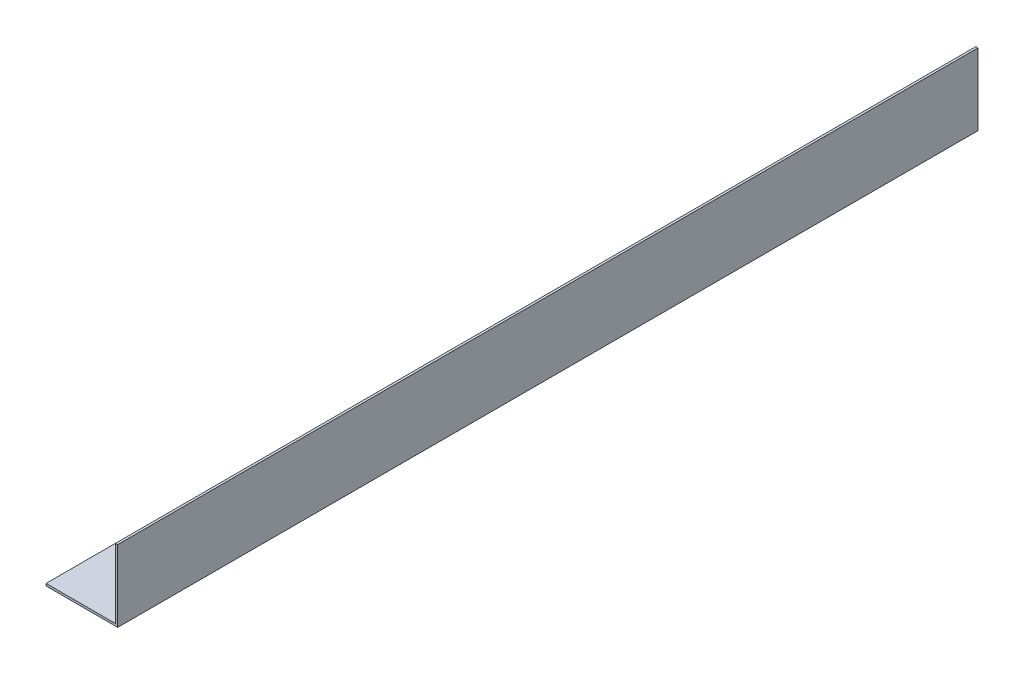
ISO-10303-21;
HEADER;
FILE_DESCRIPTION(('STEP AP214'),'2;1');
FILE_NAME('part.step','',(''),(''),'','','');
FILE_SCHEMA(('AUTOMOTIVE_DESIGN { 1 0 10303 214 1 1 1 1 }'));
ENDSEC;
DATA;
#1=APPLICATION_CONTEXT('core data for automotive mechanical design processes');
#2=APPLICATION_PROTOCOL_DEFINITION('international standard','automotive_design',2000,#1);
#3=PRODUCT_CONTEXT('',#1,'mechanical');
#4=PRODUCT('Part','Part','',(#3));
#5=PRODUCT_RELATED_PRODUCT_CATEGORY('part','',(#4));
#6=PRODUCT_DEFINITION_FORMATION('','',#4);
#7=PRODUCT_DEFINITION_CONTEXT('part definition',#1,'design');
#8=PRODUCT_DEFINITION('design','',#6,#7);
#9=PRODUCT_DEFINITION_SHAPE('','',#8);
#10=(LENGTH_UNIT() NAMED_UNIT(*) SI_UNIT(.MILLI.,.METRE.));
#11=(NAMED_UNIT(*) PLANE_ANGLE_UNIT() SI_UNIT($,.RADIAN.));
#12=(NAMED_UNIT(*) SI_UNIT($,.STERADIAN.) SOLID_ANGLE_UNIT());
#13=UNCERTAINTY_MEASURE_WITH_UNIT(LENGTH_MEASURE(1.E-05),#10,'distance_accuracy_value','');
#14=(GEOMETRIC_REPRESENTATION_CONTEXT(3) GLOBAL_UNCERTAINTY_ASSIGNED_CONTEXT((#13)) GLOBAL_UNIT_ASSIGNED_CONTEXT((#10,
#11,#12)) REPRESENTATION_CONTEXT('',''));
#15=CARTESIAN_POINT('',(0.,0.,0.));
#16=DIRECTION('',(0.,0.,1.));
#17=DIRECTION('',(1.,0.,0.));
#18=AXIS2_PLACEMENT_3D('',#15,#16,#17);
#19=CARTESIAN_POINT('',(0.,1.5875,609.6));
#20=DIRECTION('',(1.,0.,0.));
#21=DIRECTION('',(0.,1.,0.));
#22=AXIS2_PLACEMENT_3D('',#19,#20,#21);
#23=PLANE('',#22);
#24=DIRECTION('',(0.,-1.,0.));
#25=VECTOR('',#24,1.);
#26=CARTESIAN_POINT('',(0.,1.5875,0.));
#27=LINE('',#26,#25);
#28=CARTESIAN_POINT('',(0.,1.5875,0.));
#29=VERTEX_POINT('',#28);
#30=CARTESIAN_POINT('',(0.,0.,0.));
#31=VERTEX_POINT('',#30);
#32=EDGE_CURVE('E175',#29,#31,#27,.T.);
#33=ORIENTED_EDGE('',*,*,#32,.T.);
#34=DIRECTION('',(0.,0.,-1.));
#35=VECTOR('',#34,1.);
#36=CARTESIAN_POINT('',(0.,0.,609.6));
#37=LINE('',#36,#35);
#38=CARTESIAN_POINT('',(0.,0.,609.6));
#39=VERTEX_POINT('',#38);
#40=EDGE_CURVE('E222',#39,#31,#37,.T.);
#41=ORIENTED_EDGE('',*,*,#40,.F.);
#42=DIRECTION('',(0.,-1.,0.));
#43=VECTOR('',#42,1.);
#44=CARTESIAN_POINT('',(0.,1.5875,609.6));
#45=LINE('',#44,#43);
#46=CARTESIAN_POINT('',(0.,1.5875,609.6));
#47=VERTEX_POINT('',#46);
#48=EDGE_CURVE('E182',#47,#39,#45,.T.);
#49=ORIENTED_EDGE('',*,*,#48,.F.);
#50=DIRECTION('',(0.,0.,-1.));
#51=VECTOR('',#50,1.);
#52=CARTESIAN_POINT('',(0.,1.5875,609.6));
#53=LINE('',#52,#51);
#54=EDGE_CURVE('E196',#47,#29,#53,.T.);
#55=ORIENTED_EDGE('',*,*,#54,.T.);
#56=EDGE_LOOP('',(#33,#41,#49,#55));
#57=FACE_BOUND('',#56,.T.);
#58=ADVANCED_FACE('F33',(#57),#23,.F.);
#59=CARTESIAN_POINT('',(0.,0.,609.6));
#60=DIRECTION('',(0.,1.,0.));
#61=DIRECTION('',(0.,0.,1.));
#62=AXIS2_PLACEMENT_3D('',#59,#60,#61);
#63=PLANE('',#62);
#64=DIRECTION('',(-1.,0.,0.));
#65=VECTOR('',#64,1.);
#66=CARTESIAN_POINT('',(36.7071748683856,0.,61.2521));
#67=LINE('',#66,#65);
#68=CARTESIAN_POINT('',(36.7071748683856,0.,61.2521));
#69=VERTEX_POINT('',#68);
#70=CARTESIAN_POINT('',(20.6375,0.,61.2521));
#71=VERTEX_POINT('',#70);
#72=EDGE_CURVE('E145',#69,#71,#67,.T.);
#73=ORIENTED_EDGE('',*,*,#72,.F.);
#74=CARTESIAN_POINT('',(36.7071748683856,0.,57.15));
#75=DIRECTION('',(0.,-1.,0.));
#76=DIRECTION('',(0.,0.,1.));
#77=AXIS2_PLACEMENT_3D('',#74,#75,#76);
#78=CIRCLE('',#77,4.1021);
#79=CARTESIAN_POINT('',(36.7071748683856,0.,53.0479));
#80=VERTEX_POINT('',#79);
#81=EDGE_CURVE('E47',#80,#69,#78,.T.);
#82=ORIENTED_EDGE('',*,*,#81,.F.);
#83=DIRECTION('',(1.,0.,0.));
#84=VECTOR('',#83,1.);
#85=CARTESIAN_POINT('',(20.6375,0.,53.0479));
#86=LINE('',#85,#84);
#87=CARTESIAN_POINT('',(20.6375,0.,53.0479));
#88=VERTEX_POINT('',#87);
#89=EDGE_CURVE('E152',#88,#80,#86,.T.);
#90=ORIENTED_EDGE('',*,*,#89,.F.);
#91=CARTESIAN_POINT('',(20.6375,0.,57.15));
#92=DIRECTION('',(0.,-1.,0.));
#93=DIRECTION('',(0.,0.,1.));
#94=AXIS2_PLACEMENT_3D('',#91,#92,#93);
#95=CIRCLE('',#94,4.1021);
#96=EDGE_CURVE('E136',#71,#88,#95,.T.);
#97=ORIENTED_EDGE('',*,*,#96,.F.);
#98=EDGE_LOOP('',(#73,#82,#90,#97));
#99=FACE_BOUND('',#98,.T.);
#100=DIRECTION('',(1.,0.,0.));
#101=VECTOR('',#100,1.);
#102=CARTESIAN_POINT('',(36.7071748683856,0.,548.3479));
#103=LINE('',#102,#101);
#104=CARTESIAN_POINT('',(20.6375,0.,548.3479));
#105=VERTEX_POINT('',#104);
#106=CARTESIAN_POINT('',(36.7071748683856,0.,548.3479));
#107=VERTEX_POINT('',#106);
#108=EDGE_CURVE('E163',#105,#107,#103,.T.);
#109=ORIENTED_EDGE('',*,*,#108,.F.);
#110=CARTESIAN_POINT('',(20.6375,0.,552.45));
#111=DIRECTION('',(0.,-1.,0.));
#112=DIRECTION('',(0.,0.,-1.));
#113=AXIS2_PLACEMENT_3D('',#110,#111,#112);
#114=CIRCLE('',#113,4.1021);
#115=CARTESIAN_POINT('',(20.6375,0.,556.5521));
#116=VERTEX_POINT('',#115);
#117=EDGE_CURVE('E159',#116,#105,#114,.T.);
#118=ORIENTED_EDGE('',*,*,#117,.F.);
#119=DIRECTION('',(-1.,0.,0.));
#120=VECTOR('',#119,1.);
#121=CARTESIAN_POINT('',(20.6375,0.,556.5521));
#122=LINE('',#121,#120);
#123=CARTESIAN_POINT('',(36.7071748683856,0.,556.5521));
#124=VERTEX_POINT('',#123);
#125=EDGE_CURVE('E169',#124,#116,#122,.T.);
#126=ORIENTED_EDGE('',*,*,#125,.F.);
#127=CARTESIAN_POINT('',(36.7071748683856,0.,552.45));
#128=DIRECTION('',(0.,-1.,0.));
#129=DIRECTION('',(0.,0.,-1.));
#130=AXIS2_PLACEMENT_3D('',#127,#128,#129);
#131=CIRCLE('',#130,4.1021);
#132=EDGE_CURVE('E166',#107,#124,#131,.T.);
#133=ORIENTED_EDGE('',*,*,#132,.F.);
#134=EDGE_LOOP('',(#109,#118,#126,#133));
#135=FACE_BOUND('',#134,.T.);
#136=DIRECTION('',(1.,0.,0.));
#137=VECTOR('',#136,1.);
#138=CARTESIAN_POINT('',(0.,0.,0.));
#139=LINE('',#138,#137);
#140=CARTESIAN_POINT('',(50.8,0.,0.));
#141=VERTEX_POINT('',#140);
#142=EDGE_CURVE('E199',#31,#141,#139,.T.);
#143=ORIENTED_EDGE('',*,*,#142,.T.);
#144=DIRECTION('',(0.,0.,-1.));
#145=VECTOR('',#144,1.);
#146=CARTESIAN_POINT('',(50.8,0.,609.6));
#147=LINE('',#146,#145);
#148=CARTESIAN_POINT('',(50.8,0.,609.6));
#149=VERTEX_POINT('',#148);
#150=EDGE_CURVE('E219',#149,#141,#147,.T.);
#151=ORIENTED_EDGE('',*,*,#150,.F.);
#152=DIRECTION('',(1.,0.,0.));
#153=VECTOR('',#152,1.);
#154=CARTESIAN_POINT('',(0.,0.,609.6));
#155=LINE('',#154,#153);
#156=EDGE_CURVE('E185',#39,#149,#155,.T.);
#157=ORIENTED_EDGE('',*,*,#156,.F.);
#158=ORIENTED_EDGE('',*,*,#40,.T.);
#159=EDGE_LOOP('',(#143,#151,#157,#158));
#160=FACE_BOUND('',#159,.T.);
#161=ADVANCED_FACE('F149',(#99,#135,#160),#63,.F.);
#162=CARTESIAN_POINT('',(50.8,0.,609.6));
#163=DIRECTION('',(-1.,0.,0.));
#164=DIRECTION('',(0.,0.,1.));
#165=AXIS2_PLACEMENT_3D('',#162,#163,#164);
#166=PLANE('',#165);
#167=DIRECTION('',(0.,1.,0.));
#168=VECTOR('',#167,1.);
#169=CARTESIAN_POINT('',(50.8,0.,0.));
#170=LINE('',#169,#168);
#171=CARTESIAN_POINT('',(50.8,50.8,0.));
#172=VERTEX_POINT('',#171);
#173=EDGE_CURVE('E201',#141,#172,#170,.T.);
#174=ORIENTED_EDGE('',*,*,#173,.T.);
#175=DIRECTION('',(0.,0.,-1.));
#176=VECTOR('',#175,1.);
#177=CARTESIAN_POINT('',(50.8,50.8,609.6));
#178=LINE('',#177,#176);
#179=CARTESIAN_POINT('',(50.8,50.8,609.6));
#180=VERTEX_POINT('',#179);
#181=EDGE_CURVE('E216',#180,#172,#178,.T.);
#182=ORIENTED_EDGE('',*,*,#181,.F.);
#183=DIRECTION('',(0.,1.,0.));
#184=VECTOR('',#183,1.);
#185=CARTESIAN_POINT('',(50.8,0.,609.6));
#186=LINE('',#185,#184);
#187=EDGE_CURVE('E188',#149,#180,#186,.T.);
#188=ORIENTED_EDGE('',*,*,#187,.F.);
#189=ORIENTED_EDGE('',*,*,#150,.T.);
#190=EDGE_LOOP('',(#174,#182,#188,#189));
#191=FACE_BOUND('',#190,.T.);
#192=ADVANCED_FACE('F265',(#191),#166,.F.);
#193=CARTESIAN_POINT('',(50.8,50.8,609.6));
#194=DIRECTION('',(0.,-1.,0.));
#195=DIRECTION('',(0.,0.,-1.));
#196=AXIS2_PLACEMENT_3D('',#193,#194,#195);
#197=PLANE('',#196);
#198=DIRECTION('',(-1.,0.,0.));
#199=VECTOR('',#198,1.);
#200=CARTESIAN_POINT('',(50.8,50.8,0.));
#201=LINE('',#200,#199);
#202=CARTESIAN_POINT('',(49.2125,50.8,0.));
#203=VERTEX_POINT('',#202);
#204=EDGE_CURVE('E203',#172,#203,#201,.T.);
#205=ORIENTED_EDGE('',*,*,#204,.T.);
#206=DIRECTION('',(0.,0.,-1.));
#207=VECTOR('',#206,1.);
#208=CARTESIAN_POINT('',(49.2125,50.8,609.6));
#209=LINE('',#208,#207);
#210=CARTESIAN_POINT('',(49.2125,50.8,609.6));
#211=VERTEX_POINT('',#210);
#212=EDGE_CURVE('E213',#211,#203,#209,.T.);
#213=ORIENTED_EDGE('',*,*,#212,.F.);
#214=DIRECTION('',(-1.,0.,0.));
#215=VECTOR('',#214,1.);
#216=CARTESIAN_POINT('',(50.8,50.8,609.6));
#217=LINE('',#216,#215);
#218=EDGE_CURVE('E190',#180,#211,#217,.T.);
#219=ORIENTED_EDGE('',*,*,#218,.F.);
#220=ORIENTED_EDGE('',*,*,#181,.T.);
#221=EDGE_LOOP('',(#205,#213,#219,#220));
#222=FACE_BOUND('',#221,.T.);
#223=ADVANCED_FACE('F289',(#222),#197,.F.);
#224=CARTESIAN_POINT('',(49.2125,50.8,609.6));
#225=DIRECTION('',(1.,0.,0.));
#226=DIRECTION('',(0.,1.,0.));
#227=AXIS2_PLACEMENT_3D('',#224,#225,#226);
#228=PLANE('',#227);
#229=DIRECTION('',(0.,-1.,0.));
#230=VECTOR('',#229,1.);
#231=CARTESIAN_POINT('',(49.2125,50.8,0.));
#232=LINE('',#231,#230);
#233=CARTESIAN_POINT('',(49.2125,1.58750000000001,0.));
#234=VERTEX_POINT('',#233);
#235=EDGE_CURVE('E205',#203,#234,#232,.T.);
#236=ORIENTED_EDGE('',*,*,#235,.T.);
#237=DIRECTION('',(0.,0.,-1.));
#238=VECTOR('',#237,1.);
#239=CARTESIAN_POINT('',(49.2125,1.58750000000001,609.6));
#240=LINE('',#239,#238);
#241=CARTESIAN_POINT('',(49.2125,1.58750000000001,609.6));
#242=VERTEX_POINT('',#241);
#243=EDGE_CURVE('E210',#242,#234,#240,.T.);
#244=ORIENTED_EDGE('',*,*,#243,.F.);
#245=DIRECTION('',(0.,-1.,0.));
#246=VECTOR('',#245,1.);
#247=CARTESIAN_POINT('',(49.2125,50.8,609.6));
#248=LINE('',#247,#246);
#249=EDGE_CURVE('E192',#211,#242,#248,.T.);
#250=ORIENTED_EDGE('',*,*,#249,.F.);
#251=ORIENTED_EDGE('',*,*,#212,.T.);
#252=EDGE_LOOP('',(#236,#244,#250,#251));
#253=FACE_BOUND('',#252,.T.);
#254=ADVANCED_FACE('F286',(#253),#228,.F.);
#255=CARTESIAN_POINT('',(49.2125,1.58750000000001,609.6));
#256=DIRECTION('',(0.,-1.,0.));
#257=DIRECTION('',(1.,0.,0.));
#258=AXIS2_PLACEMENT_3D('',#255,#256,#257);
#259=PLANE('',#258);
#260=DIRECTION('',(1.,0.,0.));
#261=VECTOR('',#260,1.);
#262=CARTESIAN_POINT('',(49.2125,1.58750000000001,53.0479));
#263=LINE('',#262,#261);
#264=CARTESIAN_POINT('',(20.6375,1.5875,53.0479));
#265=VERTEX_POINT('',#264);
#266=CARTESIAN_POINT('',(36.7071748683856,1.58750000000001,53.0479));
#267=VERTEX_POINT('',#266);
#268=EDGE_CURVE('E40',#265,#267,#263,.T.);
#269=ORIENTED_EDGE('',*,*,#268,.T.);
#270=CARTESIAN_POINT('',(36.7071748683856,1.58750000000001,57.15));
#271=DIRECTION('',(0.,-1.,0.));
#272=DIRECTION('',(1.,0.,0.));
#273=AXIS2_PLACEMENT_3D('',#270,#271,#272);
#274=CIRCLE('',#273,4.1021);
#275=CARTESIAN_POINT('',(36.7071748683856,1.58750000000001,61.2521));
#276=VERTEX_POINT('',#275);
#277=EDGE_CURVE('E11',#267,#276,#274,.T.);
#278=ORIENTED_EDGE('',*,*,#277,.T.);
#279=DIRECTION('',(-1.,0.,0.));
#280=VECTOR('',#279,1.);
#281=CARTESIAN_POINT('',(49.2125,1.58750000000001,61.2521));
#282=LINE('',#281,#280);
#283=CARTESIAN_POINT('',(20.6375,1.5875,61.2521));
#284=VERTEX_POINT('',#283);
#285=EDGE_CURVE('E237',#276,#284,#282,.T.);
#286=ORIENTED_EDGE('',*,*,#285,.T.);
#287=CARTESIAN_POINT('',(20.6375,1.5875,57.15));
#288=DIRECTION('',(0.,-1.,0.));
#289=DIRECTION('',(1.,0.,0.));
#290=AXIS2_PLACEMENT_3D('',#287,#288,#289);
#291=CIRCLE('',#290,4.1021);
#292=EDGE_CURVE('E139',#284,#265,#291,.T.);
#293=ORIENTED_EDGE('',*,*,#292,.T.);
#294=EDGE_LOOP('',(#269,#278,#286,#293));
#295=FACE_BOUND('',#294,.T.);
#296=DIRECTION('',(-1.,0.,0.));
#297=VECTOR('',#296,1.);
#298=CARTESIAN_POINT('',(49.2125,1.58750000000001,556.5521));
#299=LINE('',#298,#297);
#300=CARTESIAN_POINT('',(36.7071748683856,1.58750000000001,556.5521));
#301=VERTEX_POINT('',#300);
#302=CARTESIAN_POINT('',(20.6375,1.58750000000001,556.5521));
#303=VERTEX_POINT('',#302);
#304=EDGE_CURVE('E231',#301,#303,#299,.T.);
#305=ORIENTED_EDGE('',*,*,#304,.T.);
#306=CARTESIAN_POINT('',(20.6375,1.5875,552.45));
#307=DIRECTION('',(0.,-1.,0.));
#308=DIRECTION('',(1.,0.,0.));
#309=AXIS2_PLACEMENT_3D('',#306,#307,#308);
#310=CIRCLE('',#309,4.1021);
#311=CARTESIAN_POINT('',(20.6375,1.58750000000001,548.3479));
#312=VERTEX_POINT('',#311);
#313=EDGE_CURVE('E234',#303,#312,#310,.T.);
#314=ORIENTED_EDGE('',*,*,#313,.T.);
#315=DIRECTION('',(1.,0.,0.));
#316=VECTOR('',#315,1.);
#317=CARTESIAN_POINT('',(49.2125,1.58750000000001,548.3479));
#318=LINE('',#317,#316);
#319=CARTESIAN_POINT('',(36.7071748683856,1.5875,548.3479));
#320=VERTEX_POINT('',#319);
#321=EDGE_CURVE('E225',#312,#320,#318,.T.);
#322=ORIENTED_EDGE('',*,*,#321,.T.);
#323=CARTESIAN_POINT('',(36.7071748683856,1.58750000000001,552.45));
#324=DIRECTION('',(0.,-1.,0.));
#325=DIRECTION('',(1.,0.,0.));
#326=AXIS2_PLACEMENT_3D('',#323,#324,#325);
#327=CIRCLE('',#326,4.1021);
#328=EDGE_CURVE('E228',#320,#301,#327,.T.);
#329=ORIENTED_EDGE('',*,*,#328,.T.);
#330=EDGE_LOOP('',(#305,#314,#322,#329));
#331=FACE_BOUND('',#330,.T.);
#332=DIRECTION('',(-1.,0.,0.));
#333=VECTOR('',#332,1.);
#334=CARTESIAN_POINT('',(49.2125,1.58750000000001,0.));
#335=LINE('',#334,#333);
#336=EDGE_CURVE('E186',#234,#29,#335,.T.);
#337=ORIENTED_EDGE('',*,*,#336,.T.);
#338=ORIENTED_EDGE('',*,*,#54,.F.);
#339=DIRECTION('',(-1.,0.,0.));
#340=VECTOR('',#339,1.);
#341=CARTESIAN_POINT('',(49.2125,1.58750000000001,609.6));
#342=LINE('',#341,#340);
#343=EDGE_CURVE('E194',#242,#47,#342,.T.);
#344=ORIENTED_EDGE('',*,*,#343,.F.);
#345=ORIENTED_EDGE('',*,*,#243,.T.);
#346=EDGE_LOOP('',(#337,#338,#344,#345));
#347=FACE_BOUND('',#346,.T.);
#348=ADVANCED_FACE('F241',(#295,#331,#347),#259,.F.);
#349=CARTESIAN_POINT('',(0.,0.,609.6));
#350=DIRECTION('',(0.,0.,1.));
#351=DIRECTION('',(1.,0.,0.));
#352=AXIS2_PLACEMENT_3D('',#349,#350,#351);
#353=PLANE('',#352);
#354=ORIENTED_EDGE('',*,*,#48,.T.);
#355=ORIENTED_EDGE('',*,*,#156,.T.);
#356=ORIENTED_EDGE('',*,*,#187,.T.);
#357=ORIENTED_EDGE('',*,*,#218,.T.);
#358=ORIENTED_EDGE('',*,*,#249,.T.);
#359=ORIENTED_EDGE('',*,*,#343,.T.);
#360=EDGE_LOOP('',(#354,#355,#356,#357,#358,#359));
#361=FACE_BOUND('',#360,.T.);
#362=ADVANCED_FACE('F280',(#361),#353,.T.);
#363=CARTESIAN_POINT('',(0.,0.,0.));
#364=DIRECTION('',(0.,0.,1.));
#365=DIRECTION('',(1.,0.,0.));
#366=AXIS2_PLACEMENT_3D('',#363,#364,#365);
#367=PLANE('',#366);
#368=ORIENTED_EDGE('',*,*,#32,.F.);
#369=ORIENTED_EDGE('',*,*,#336,.F.);
#370=ORIENTED_EDGE('',*,*,#235,.F.);
#371=ORIENTED_EDGE('',*,*,#204,.F.);
#372=ORIENTED_EDGE('',*,*,#173,.F.);
#373=ORIENTED_EDGE('',*,*,#142,.F.);
#374=EDGE_LOOP('',(#368,#369,#370,#371,#372,#373));
#375=FACE_BOUND('',#374,.T.);
#376=ADVANCED_FACE('F272',(#375),#367,.F.);
#377=CARTESIAN_POINT('',(20.6375,50.8,552.45));
#378=DIRECTION('',(0.,-1.,0.));
#379=DIRECTION('',(0.,0.,-1.));
#380=AXIS2_PLACEMENT_3D('',#377,#378,#379);
#381=CYLINDRICAL_SURFACE('',#380,4.1021);
#382=DIRECTION('',(0.,-1.,0.));
#383=VECTOR('',#382,1.);
#384=CARTESIAN_POINT('',(20.6375,50.8,556.5521));
#385=LINE('',#384,#383);
#386=EDGE_CURVE('E173',#303,#116,#385,.T.);
#387=ORIENTED_EDGE('',*,*,#386,.T.);
#388=ORIENTED_EDGE('',*,*,#117,.T.);
#389=DIRECTION('',(0.,-1.,0.));
#390=VECTOR('',#389,1.);
#391=CARTESIAN_POINT('',(20.6375,50.8,548.3479));
#392=LINE('',#391,#390);
#393=EDGE_CURVE('E172',#312,#105,#392,.T.);
#394=ORIENTED_EDGE('',*,*,#393,.F.);
#395=ORIENTED_EDGE('',*,*,#313,.F.);
#396=EDGE_LOOP('',(#387,#388,#394,#395));
#397=FACE_BOUND('',#396,.T.);
#398=ADVANCED_FACE('F306',(#397),#381,.F.);
#399=CARTESIAN_POINT('',(20.6375,50.8,556.5521));
#400=DIRECTION('',(0.,0.,1.));
#401=DIRECTION('',(1.,0.,0.));
#402=AXIS2_PLACEMENT_3D('',#399,#400,#401);
#403=PLANE('',#402);
#404=DIRECTION('',(0.,-1.,0.));
#405=VECTOR('',#404,1.);
#406=CARTESIAN_POINT('',(36.7071748683856,50.8,556.5521));
#407=LINE('',#406,#405);
#408=EDGE_CURVE('E176',#301,#124,#407,.T.);
#409=ORIENTED_EDGE('',*,*,#408,.T.);
#410=ORIENTED_EDGE('',*,*,#125,.T.);
#411=ORIENTED_EDGE('',*,*,#386,.F.);
#412=ORIENTED_EDGE('',*,*,#304,.F.);
#413=EDGE_LOOP('',(#409,#410,#411,#412));
#414=FACE_BOUND('',#413,.T.);
#415=ADVANCED_FACE('F310',(#414),#403,.F.);
#416=CARTESIAN_POINT('',(36.7071748683856,50.8,552.45));
#417=DIRECTION('',(0.,-1.,0.));
#418=DIRECTION('',(0.,0.,-1.));
#419=AXIS2_PLACEMENT_3D('',#416,#417,#418);
#420=CYLINDRICAL_SURFACE('',#419,4.1021);
#421=DIRECTION('',(0.,-1.,0.));
#422=VECTOR('',#421,1.);
#423=CARTESIAN_POINT('',(36.7071748683856,50.8,548.3479));
#424=LINE('',#423,#422);
#425=EDGE_CURVE('E178',#320,#107,#424,.T.);
#426=ORIENTED_EDGE('',*,*,#425,.T.);
#427=ORIENTED_EDGE('',*,*,#132,.T.);
#428=ORIENTED_EDGE('',*,*,#408,.F.);
#429=ORIENTED_EDGE('',*,*,#328,.F.);
#430=EDGE_LOOP('',(#426,#427,#428,#429));
#431=FACE_BOUND('',#430,.T.);
#432=ADVANCED_FACE('F255',(#431),#420,.F.);
#433=CARTESIAN_POINT('',(36.7071748683856,50.8,548.3479));
#434=DIRECTION('',(0.,0.,-1.));
#435=DIRECTION('',(-1.,0.,0.));
#436=AXIS2_PLACEMENT_3D('',#433,#434,#435);
#437=PLANE('',#436);
#438=ORIENTED_EDGE('',*,*,#393,.T.);
#439=ORIENTED_EDGE('',*,*,#108,.T.);
#440=ORIENTED_EDGE('',*,*,#425,.F.);
#441=ORIENTED_EDGE('',*,*,#321,.F.);
#442=EDGE_LOOP('',(#438,#439,#440,#441));
#443=FACE_BOUND('',#442,.T.);
#444=ADVANCED_FACE('F248',(#443),#437,.F.);
#445=CARTESIAN_POINT('',(36.7071748683856,50.8,57.15));
#446=DIRECTION('',(0.,-1.,0.));
#447=DIRECTION('',(0.,0.,-1.));
#448=AXIS2_PLACEMENT_3D('',#445,#446,#447);
#449=CYLINDRICAL_SURFACE('',#448,4.1021);
#450=DIRECTION('',(0.,-1.,0.));
#451=VECTOR('',#450,1.);
#452=CARTESIAN_POINT('',(36.7071748683856,50.8,53.0479));
#453=LINE('',#452,#451);
#454=EDGE_CURVE('E157',#267,#80,#453,.T.);
#455=ORIENTED_EDGE('',*,*,#454,.T.);
#456=ORIENTED_EDGE('',*,*,#81,.T.);
#457=DIRECTION('',(0.,-1.,0.));
#458=VECTOR('',#457,1.);
#459=CARTESIAN_POINT('',(36.7071748683856,50.8,61.2521));
#460=LINE('',#459,#458);
#461=EDGE_CURVE('E142',#276,#69,#460,.T.);
#462=ORIENTED_EDGE('',*,*,#461,.F.);
#463=ORIENTED_EDGE('',*,*,#277,.F.);
#464=EDGE_LOOP('',(#455,#456,#462,#463));
#465=FACE_BOUND('',#464,.T.);
#466=ADVANCED_FACE('F246',(#465),#449,.F.);
#467=CARTESIAN_POINT('',(20.6375,50.8,53.0479));
#468=DIRECTION('',(0.,0.,-1.));
#469=DIRECTION('',(-1.,0.,0.));
#470=AXIS2_PLACEMENT_3D('',#467,#468,#469);
#471=PLANE('',#470);
#472=DIRECTION('',(0.,-1.,0.));
#473=VECTOR('',#472,1.);
#474=CARTESIAN_POINT('',(20.6375,50.8,53.0479));
#475=LINE('',#474,#473);
#476=EDGE_CURVE('E141',#265,#88,#475,.T.);
#477=ORIENTED_EDGE('',*,*,#476,.T.);
#478=ORIENTED_EDGE('',*,*,#89,.T.);
#479=ORIENTED_EDGE('',*,*,#454,.F.);
#480=ORIENTED_EDGE('',*,*,#268,.F.);
#481=EDGE_LOOP('',(#477,#478,#479,#480));
#482=FACE_BOUND('',#481,.T.);
#483=ADVANCED_FACE('F245',(#482),#471,.F.);
#484=CARTESIAN_POINT('',(20.6375,50.8,57.15));
#485=DIRECTION('',(0.,-1.,0.));
#486=DIRECTION('',(0.,0.,-1.));
#487=AXIS2_PLACEMENT_3D('',#484,#485,#486);
#488=CYLINDRICAL_SURFACE('',#487,4.1021);
#489=DIRECTION('',(0.,-1.,0.));
#490=VECTOR('',#489,1.);
#491=CARTESIAN_POINT('',(20.6375,50.8,61.2521));
#492=LINE('',#491,#490);
#493=EDGE_CURVE('E55',#284,#71,#492,.T.);
#494=ORIENTED_EDGE('',*,*,#493,.T.);
#495=ORIENTED_EDGE('',*,*,#96,.T.);
#496=ORIENTED_EDGE('',*,*,#476,.F.);
#497=ORIENTED_EDGE('',*,*,#292,.F.);
#498=EDGE_LOOP('',(#494,#495,#496,#497));
#499=FACE_BOUND('',#498,.T.);
#500=ADVANCED_FACE('F133',(#499),#488,.F.);
#501=CARTESIAN_POINT('',(36.7071748683856,50.8,61.2521));
#502=DIRECTION('',(0.,0.,1.));
#503=DIRECTION('',(1.,0.,0.));
#504=AXIS2_PLACEMENT_3D('',#501,#502,#503);
#505=PLANE('',#504);
#506=ORIENTED_EDGE('',*,*,#461,.T.);
#507=ORIENTED_EDGE('',*,*,#72,.T.);
#508=ORIENTED_EDGE('',*,*,#493,.F.);
#509=ORIENTED_EDGE('',*,*,#285,.F.);
#510=EDGE_LOOP('',(#506,#507,#508,#509));
#511=FACE_BOUND('',#510,.T.);
#512=ADVANCED_FACE('F146',(#511),#505,.F.);
#513=CLOSED_SHELL('',(#58,#161,#192,#223,#254,#348,#362,#376,#398,#415,#432,#444,#466,#483,#500,#512));
#514=MANIFOLD_SOLID_BREP('B2',#513);
#515=ADVANCED_BREP_SHAPE_REPRESENTATION('',(#18,#514),#14);
#516=SHAPE_DEFINITION_REPRESENTATION(#9,#515);
ENDSEC;
END-ISO-10303-21;
